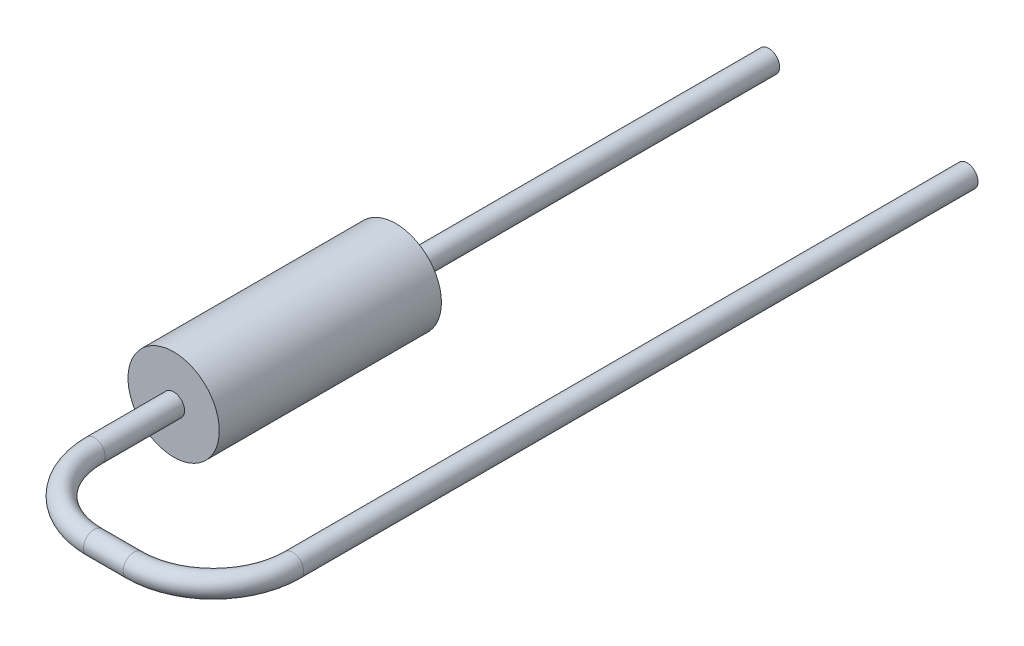
ISO-10303-21;
HEADER;
FILE_DESCRIPTION(('STEP AP214'),'2;1');
FILE_NAME('part.step','',(''),(''),'','','');
FILE_SCHEMA(('AUTOMOTIVE_DESIGN { 1 0 10303 214 1 1 1 1 }'));
ENDSEC;
DATA;
#1=APPLICATION_CONTEXT('core data for automotive mechanical design processes');
#2=APPLICATION_PROTOCOL_DEFINITION('international standard','automotive_design',2000,#1);
#3=PRODUCT_CONTEXT('',#1,'mechanical');
#4=PRODUCT('Part','Part','',(#3));
#5=PRODUCT_RELATED_PRODUCT_CATEGORY('part','',(#4));
#6=PRODUCT_DEFINITION_FORMATION('','',#4);
#7=PRODUCT_DEFINITION_CONTEXT('part definition',#1,'design');
#8=PRODUCT_DEFINITION('design','',#6,#7);
#9=PRODUCT_DEFINITION_SHAPE('','',#8);
#10=(LENGTH_UNIT() NAMED_UNIT(*) SI_UNIT(.MILLI.,.METRE.));
#11=(NAMED_UNIT(*) PLANE_ANGLE_UNIT() SI_UNIT($,.RADIAN.));
#12=(NAMED_UNIT(*) SI_UNIT($,.STERADIAN.) SOLID_ANGLE_UNIT());
#13=UNCERTAINTY_MEASURE_WITH_UNIT(LENGTH_MEASURE(1.E-05),#10,'distance_accuracy_value','');
#14=(GEOMETRIC_REPRESENTATION_CONTEXT(3) GLOBAL_UNCERTAINTY_ASSIGNED_CONTEXT((#13)) GLOBAL_UNIT_ASSIGNED_CONTEXT((#10,
#11,#12)) REPRESENTATION_CONTEXT('',''));
#15=CARTESIAN_POINT('',(0.,0.,0.));
#16=DIRECTION('',(0.,0.,1.));
#17=DIRECTION('',(1.,0.,0.));
#18=AXIS2_PLACEMENT_3D('',#15,#16,#17);
#19=CARTESIAN_POINT('',(0.,0.,0.));
#20=DIRECTION('',(0.,0.,1.));
#21=DIRECTION('',(1.,0.,0.));
#22=AXIS2_PLACEMENT_3D('',#19,#20,#21);
#23=PLANE('',#22);
#24=CARTESIAN_POINT('',(0.,0.,0.));
#25=DIRECTION('',(0.,0.,1.));
#26=DIRECTION('',(1.,0.,0.));
#27=AXIS2_PLACEMENT_3D('',#24,#25,#26);
#28=CIRCLE('',#27,1.15);
#29=CARTESIAN_POINT('',(1.15,0.,0.));
#30=VERTEX_POINT('',#29);
#31=EDGE_CURVE('E47',#30,#30,#28,.T.);
#32=ORIENTED_EDGE('',*,*,#31,.F.);
#33=EDGE_LOOP('',(#32));
#34=FACE_BOUND('',#33,.T.);
#35=CARTESIAN_POINT('',(0.,0.,0.));
#36=DIRECTION('',(0.,0.,1.));
#37=DIRECTION('',(1.,0.,0.));
#38=AXIS2_PLACEMENT_3D('',#35,#36,#37);
#39=CIRCLE('',#38,0.275);
#40=CARTESIAN_POINT('',(0.275,0.,0.));
#41=VERTEX_POINT('',#40);
#42=EDGE_CURVE('E10',#41,#41,#39,.F.);
#43=ORIENTED_EDGE('',*,*,#42,.F.);
#44=EDGE_LOOP('',(#43));
#45=FACE_BOUND('',#44,.T.);
#46=ADVANCED_FACE('F31',(#34,#45),#23,.F.);
#47=CARTESIAN_POINT('',(0.,0.,5.6));
#48=DIRECTION('',(0.,0.,-1.));
#49=DIRECTION('',(-1.,0.,0.));
#50=AXIS2_PLACEMENT_3D('',#47,#48,#49);
#51=CYLINDRICAL_SURFACE('',#50,1.15);
#52=CARTESIAN_POINT('',(0.,0.,5.6));
#53=DIRECTION('',(0.,0.,1.));
#54=DIRECTION('',(1.,0.,0.));
#55=AXIS2_PLACEMENT_3D('',#52,#53,#54);
#56=CIRCLE('',#55,1.15);
#57=CARTESIAN_POINT('',(1.15,0.,5.6));
#58=VERTEX_POINT('',#57);
#59=EDGE_CURVE('E42',#58,#58,#56,.T.);
#60=ORIENTED_EDGE('',*,*,#59,.F.);
#61=EDGE_LOOP('',(#60));
#62=FACE_BOUND('',#61,.T.);
#63=ORIENTED_EDGE('',*,*,#31,.T.);
#64=EDGE_LOOP('',(#63));
#65=FACE_BOUND('',#64,.T.);
#66=ADVANCED_FACE('F33',(#62,#65),#51,.T.);
#67=CARTESIAN_POINT('',(0.,0.,5.6));
#68=DIRECTION('',(0.,0.,1.));
#69=DIRECTION('',(1.,0.,0.));
#70=AXIS2_PLACEMENT_3D('',#67,#68,#69);
#71=PLANE('',#70);
#72=CARTESIAN_POINT('',(0.,0.,5.6));
#73=DIRECTION('',(0.,0.,1.));
#74=DIRECTION('',(1.,0.,0.));
#75=AXIS2_PLACEMENT_3D('',#72,#73,#74);
#76=CIRCLE('',#75,0.275);
#77=CARTESIAN_POINT('',(0.275,0.,5.6));
#78=VERTEX_POINT('',#77);
#79=EDGE_CURVE('E38',#78,#78,#76,.T.);
#80=ORIENTED_EDGE('',*,*,#79,.F.);
#81=EDGE_LOOP('',(#80));
#82=FACE_BOUND('',#81,.T.);
#83=ORIENTED_EDGE('',*,*,#59,.T.);
#84=EDGE_LOOP('',(#83));
#85=FACE_BOUND('',#84,.T.);
#86=ADVANCED_FACE('F73',(#82,#85),#71,.T.);
#87=CARTESIAN_POINT('',(5.,0.,7.59999999999999));
#88=DIRECTION('',(0.,0.,-1.));
#89=DIRECTION('',(-1.,0.,0.));
#90=AXIS2_PLACEMENT_3D('',#87,#88,#89);
#91=CYLINDRICAL_SURFACE('',#90,0.275);
#92=CARTESIAN_POINT('',(5.,0.,7.59999999999999));
#93=DIRECTION('',(0.,0.,-1.));
#94=DIRECTION('',(-1.,0.,0.));
#95=AXIS2_PLACEMENT_3D('',#92,#93,#94);
#96=CIRCLE('',#95,0.275);
#97=CARTESIAN_POINT('',(5.275,0.,7.59999999999999));
#98=VERTEX_POINT('',#97);
#99=EDGE_CURVE('E59',#98,#98,#96,.T.);
#100=ORIENTED_EDGE('',*,*,#99,.T.);
#101=EDGE_LOOP('',(#100));
#102=FACE_BOUND('',#101,.T.);
#103=CARTESIAN_POINT('',(5.,0.,-9.4));
#104=DIRECTION('',(0.,0.,-1.));
#105=DIRECTION('',(-1.,0.,0.));
#106=AXIS2_PLACEMENT_3D('',#103,#104,#105);
#107=CIRCLE('',#106,0.275);
#108=CARTESIAN_POINT('',(4.725,0.,-9.39999999999999));
#109=VERTEX_POINT('',#108);
#110=EDGE_CURVE('E62',#109,#109,#107,.T.);
#111=ORIENTED_EDGE('',*,*,#110,.F.);
#112=EDGE_LOOP('',(#111));
#113=FACE_BOUND('',#112,.T.);
#114=ADVANCED_FACE('F78',(#102,#113),#91,.T.);
#115=CARTESIAN_POINT('',(3.,0.,7.6));
#116=DIRECTION('',(0.,1.,0.));
#117=DIRECTION('',(0.,0.,1.));
#118=AXIS2_PLACEMENT_3D('',#115,#116,#117);
#119=TOROIDAL_SURFACE('',#118,2.,0.275);
#120=CARTESIAN_POINT('',(2.99999999999999,0.,9.6));
#121=DIRECTION('',(1.,0.,0.));
#122=DIRECTION('',(0.,0.,-1.));
#123=AXIS2_PLACEMENT_3D('',#120,#121,#122);
#124=CIRCLE('',#123,0.275);
#125=CARTESIAN_POINT('',(2.99999999999998,0.,9.875));
#126=VERTEX_POINT('',#125);
#127=EDGE_CURVE('E56',#126,#126,#124,.T.);
#128=CARTESIAN_POINT('',(3.,0.,7.6));
#129=DIRECTION('',(0.,1.,0.));
#130=DIRECTION('',(0.,0.,1.));
#131=AXIS2_PLACEMENT_3D('',#128,#129,#130);
#132=CIRCLE('',#131,2.275);
#133=EDGE_CURVE('',#126,#98,#132,.T.);
#134=ORIENTED_EDGE('',*,*,#127,.T.);
#135=ORIENTED_EDGE('',*,*,#99,.F.);
#136=ORIENTED_EDGE('',*,*,#133,.T.);
#137=ORIENTED_EDGE('',*,*,#133,.F.);
#138=EDGE_LOOP('',(#134,#136,#135,#137));
#139=FACE_BOUND('',#138,.T.);
#140=ADVANCED_FACE('F82',(#139),#119,.T.);
#141=CARTESIAN_POINT('',(2.00000000000001,0.,9.6));
#142=DIRECTION('',(1.,0.,0.));
#143=DIRECTION('',(0.,0.,-1.));
#144=AXIS2_PLACEMENT_3D('',#141,#142,#143);
#145=CYLINDRICAL_SURFACE('',#144,0.275);
#146=CARTESIAN_POINT('',(2.00000000000001,0.,9.6));
#147=DIRECTION('',(1.,0.,0.));
#148=DIRECTION('',(0.,0.,-1.));
#149=AXIS2_PLACEMENT_3D('',#146,#147,#148);
#150=CIRCLE('',#149,0.275);
#151=CARTESIAN_POINT('',(2.00000000000002,0.,9.875));
#152=VERTEX_POINT('',#151);
#153=EDGE_CURVE('E53',#152,#152,#150,.T.);
#154=ORIENTED_EDGE('',*,*,#153,.T.);
#155=EDGE_LOOP('',(#154));
#156=FACE_BOUND('',#155,.T.);
#157=ORIENTED_EDGE('',*,*,#127,.F.);
#158=EDGE_LOOP('',(#157));
#159=FACE_BOUND('',#158,.T.);
#160=ADVANCED_FACE('F86',(#156,#159),#145,.T.);
#161=CARTESIAN_POINT('',(2.,0.,7.6));
#162=DIRECTION('',(0.,1.,0.));
#163=DIRECTION('',(0.,0.,1.));
#164=AXIS2_PLACEMENT_3D('',#161,#162,#163);
#165=TOROIDAL_SURFACE('',#164,2.,0.275);
#166=CARTESIAN_POINT('',(0.,0.,7.59999999999999));
#167=DIRECTION('',(0.,0.,1.));
#168=DIRECTION('',(1.,0.,0.));
#169=AXIS2_PLACEMENT_3D('',#166,#167,#168);
#170=CIRCLE('',#169,0.275);
#171=CARTESIAN_POINT('',(-0.275000000000001,0.,7.59999999999998));
#172=VERTEX_POINT('',#171);
#173=EDGE_CURVE('E51',#172,#172,#170,.T.);
#174=CARTESIAN_POINT('',(2.,0.,7.6));
#175=DIRECTION('',(0.,1.,0.));
#176=DIRECTION('',(0.,0.,1.));
#177=AXIS2_PLACEMENT_3D('',#174,#175,#176);
#178=CIRCLE('',#177,2.275);
#179=EDGE_CURVE('',#172,#152,#178,.T.);
#180=ORIENTED_EDGE('',*,*,#173,.T.);
#181=ORIENTED_EDGE('',*,*,#153,.F.);
#182=ORIENTED_EDGE('',*,*,#179,.T.);
#183=ORIENTED_EDGE('',*,*,#179,.F.);
#184=EDGE_LOOP('',(#180,#182,#181,#183));
#185=FACE_BOUND('',#184,.T.);
#186=ADVANCED_FACE('F90',(#185),#165,.T.);
#187=CARTESIAN_POINT('',(0.,0.,7.59999999999999));
#188=DIRECTION('',(0.,0.,-1.));
#189=DIRECTION('',(-1.,0.,0.));
#190=AXIS2_PLACEMENT_3D('',#187,#188,#189);
#191=CYLINDRICAL_SURFACE('',#190,0.275);
#192=ORIENTED_EDGE('',*,*,#173,.F.);
#193=EDGE_LOOP('',(#192));
#194=FACE_BOUND('',#193,.T.);
#195=ORIENTED_EDGE('',*,*,#79,.T.);
#196=EDGE_LOOP('',(#195));
#197=FACE_BOUND('',#196,.T.);
#198=ADVANCED_FACE('F94',(#194,#197),#191,.T.);
#199=CARTESIAN_POINT('',(5.,0.,-9.4));
#200=DIRECTION('',(0.,0.,-1.));
#201=DIRECTION('',(-1.,0.,0.));
#202=AXIS2_PLACEMENT_3D('',#199,#200,#201);
#203=PLANE('',#202);
#204=ORIENTED_EDGE('',*,*,#110,.T.);
#205=EDGE_LOOP('',(#204));
#206=FACE_BOUND('',#205,.T.);
#207=ADVANCED_FACE('F98',(#206),#203,.T.);
#208=CARTESIAN_POINT('',(0.,0.,-10.1778174593051));
#209=DIRECTION('',(0.,0.,1.));
#210=DIRECTION('',(1.,0.,0.));
#211=AXIS2_PLACEMENT_3D('',#208,#209,#210);
#212=CYLINDRICAL_SURFACE('',#211,0.275);
#213=ORIENTED_EDGE('',*,*,#42,.T.);
#214=EDGE_LOOP('',(#213));
#215=FACE_BOUND('',#214,.T.);
#216=CARTESIAN_POINT('',(0.,0.,-9.39999999999986));
#217=DIRECTION('',(0.,0.,-1.));
#218=DIRECTION('',(-1.,0.,0.));
#219=AXIS2_PLACEMENT_3D('',#216,#217,#218);
#220=CIRCLE('',#219,0.275);
#221=CARTESIAN_POINT('',(-0.275,0.,-9.39999999999985));
#222=VERTEX_POINT('',#221);
#223=EDGE_CURVE('E114',#222,#222,#220,.T.);
#224=ORIENTED_EDGE('',*,*,#223,.F.);
#225=EDGE_LOOP('',(#224));
#226=FACE_BOUND('',#225,.T.);
#227=ADVANCED_FACE('F102',(#215,#226),#212,.T.);
#228=CARTESIAN_POINT('',(5.,0.,-9.4));
#229=DIRECTION('',(0.,0.,-1.));
#230=DIRECTION('',(-1.,0.,0.));
#231=AXIS2_PLACEMENT_3D('',#228,#229,#230);
#232=PLANE('',#231);
#233=ORIENTED_EDGE('',*,*,#223,.T.);
#234=EDGE_LOOP('',(#233));
#235=FACE_BOUND('',#234,.T.);
#236=ADVANCED_FACE('F104',(#235),#232,.T.);
#237=CLOSED_SHELL('',(#46,#66,#86,#114,#140,#160,#186,#198,#207,#227,#236));
#238=MANIFOLD_SOLID_BREP('B2',#237);
#239=ADVANCED_BREP_SHAPE_REPRESENTATION('',(#18,#238),#14);
#240=SHAPE_DEFINITION_REPRESENTATION(#9,#239);
ENDSEC;
END-ISO-10303-21;
